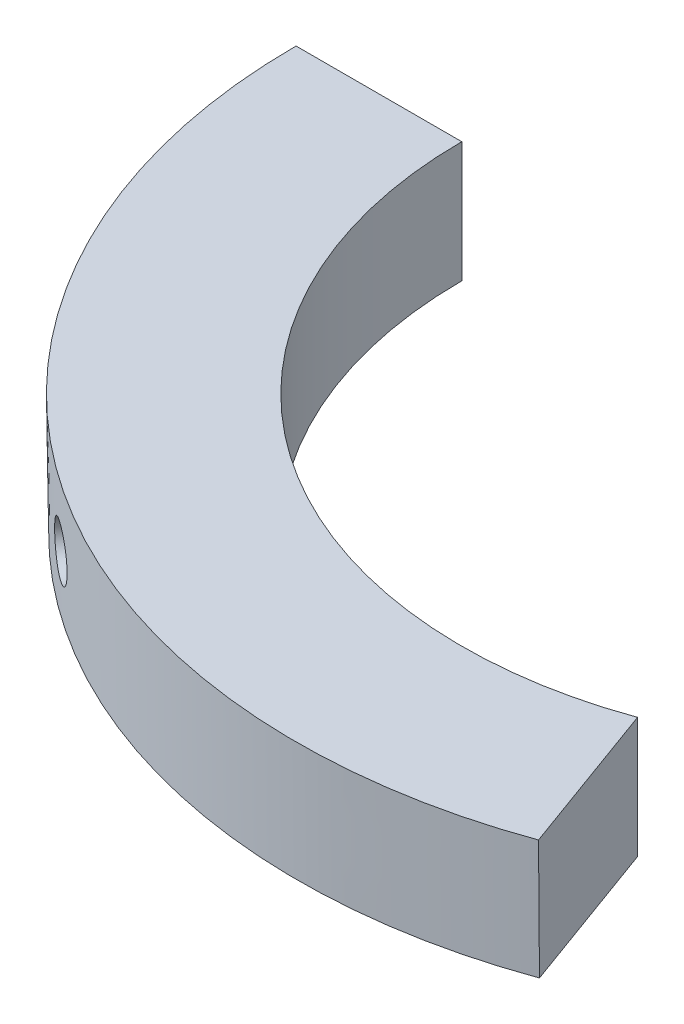
ISO-10303-21;
HEADER;
FILE_DESCRIPTION(('STEP AP214'),'2;1');
FILE_NAME('part.step','',(''),(''),'','','');
FILE_SCHEMA(('AUTOMOTIVE_DESIGN { 1 0 10303 214 1 1 1 1 }'));
ENDSEC;
DATA;
#1=APPLICATION_CONTEXT('core data for automotive mechanical design processes');
#2=APPLICATION_PROTOCOL_DEFINITION('international standard','automotive_design',2000,#1);
#3=PRODUCT_CONTEXT('',#1,'mechanical');
#4=PRODUCT('Part','Part','',(#3));
#5=PRODUCT_RELATED_PRODUCT_CATEGORY('part','',(#4));
#6=PRODUCT_DEFINITION_FORMATION('','',#4);
#7=PRODUCT_DEFINITION_CONTEXT('part definition',#1,'design');
#8=PRODUCT_DEFINITION('design','',#6,#7);
#9=PRODUCT_DEFINITION_SHAPE('','',#8);
#10=(LENGTH_UNIT() NAMED_UNIT(*) SI_UNIT(.MILLI.,.METRE.));
#11=(NAMED_UNIT(*) PLANE_ANGLE_UNIT() SI_UNIT($,.RADIAN.));
#12=(NAMED_UNIT(*) SI_UNIT($,.STERADIAN.) SOLID_ANGLE_UNIT());
#13=UNCERTAINTY_MEASURE_WITH_UNIT(LENGTH_MEASURE(1.E-05),#10,'distance_accuracy_value','');
#14=(GEOMETRIC_REPRESENTATION_CONTEXT(3) GLOBAL_UNCERTAINTY_ASSIGNED_CONTEXT((#13)) GLOBAL_UNIT_ASSIGNED_CONTEXT((#10,
#11,#12)) REPRESENTATION_CONTEXT('',''));
#15=CARTESIAN_POINT('',(0.,0.,0.));
#16=DIRECTION('',(0.,0.,1.));
#17=DIRECTION('',(1.,0.,0.));
#18=AXIS2_PLACEMENT_3D('',#15,#16,#17);
#19=CARTESIAN_POINT('',(9.91858415644451,8.,27.2510860027913));
#20=DIRECTION('',(0.,-1.,0.));
#21=DIRECTION('',(0.,0.,-1.));
#22=AXIS2_PLACEMENT_3D('',#19,#20,#21);
#23=PLANE('',#22);
#24=CARTESIAN_POINT('',(0.,8.,0.));
#25=DIRECTION('',(0.,-1.,0.));
#26=DIRECTION('',(0.,0.,-1.));
#27=AXIS2_PLACEMENT_3D('',#24,#25,#26);
#28=CIRCLE('',#27,29.);
#29=CARTESIAN_POINT('',(9.91858415644451,8.,27.2510860027913));
#30=VERTEX_POINT('',#29);
#31=CARTESIAN_POINT('',(-29.,8.,0.));
#32=VERTEX_POINT('',#31);
#33=EDGE_CURVE('E11',#30,#32,#28,.T.);
#34=ORIENTED_EDGE('',*,*,#33,.T.);
#35=DIRECTION('',(-1.,0.,0.));
#36=VECTOR('',#35,1.);
#37=CARTESIAN_POINT('',(-29.,8.,0.));
#38=LINE('',#37,#36);
#39=CARTESIAN_POINT('',(-40.,7.99999999999999,0.));
#40=VERTEX_POINT('',#39);
#41=EDGE_CURVE('E94',#32,#40,#38,.T.);
#42=ORIENTED_EDGE('',*,*,#41,.T.);
#43=CARTESIAN_POINT('',(0.,7.99999999999999,0.));
#44=DIRECTION('',(0.,-1.,0.));
#45=DIRECTION('',(0.,0.,-1.));
#46=AXIS2_PLACEMENT_3D('',#43,#44,#45);
#47=CIRCLE('',#46,40.);
#48=CARTESIAN_POINT('',(13.6808057330269,7.99999999999999,37.5877048314363));
#49=VERTEX_POINT('',#48);
#50=EDGE_CURVE('E151',#49,#40,#47,.T.);
#51=ORIENTED_EDGE('',*,*,#50,.F.);
#52=DIRECTION('',(0.342020143325673,0.,0.939692620785907));
#53=VECTOR('',#52,1.);
#54=CARTESIAN_POINT('',(9.91858415644451,8.,27.2510860027913));
#55=LINE('',#54,#53);
#56=EDGE_CURVE('E161',#30,#49,#55,.T.);
#57=ORIENTED_EDGE('',*,*,#56,.F.);
#58=EDGE_LOOP('',(#34,#42,#51,#57));
#59=FACE_BOUND('',#58,.T.);
#60=ADVANCED_FACE('F33',(#59),#23,.F.);
#61=CARTESIAN_POINT('',(0.,0.,0.));
#62=DIRECTION('',(0.,-1.,0.));
#63=DIRECTION('',(0.,0.,-1.));
#64=AXIS2_PLACEMENT_3D('',#61,#62,#63);
#65=CYLINDRICAL_SURFACE('',#64,29.);
#66=CARTESIAN_POINT('',(-16.6932287008392,0.649474551576168,23.7136272118265));
#67=CARTESIAN_POINT('',(-16.5489999556268,0.64948214656556,23.8151544921271));
#68=CARTESIAN_POINT('',(-16.4037439585356,0.664338604365094,23.9154215427874));
#69=CARTESIAN_POINT('',(-16.1154682046601,0.723376379007501,24.1106218136091));
#70=CARTESIAN_POINT('',(-15.9724510424347,0.767589464135116,24.2055491345346));
#71=CARTESIAN_POINT('',(-15.6931209410602,0.884033140541949,24.3875733311172));
#72=CARTESIAN_POINT('',(-15.5568038638344,0.956246187246734,24.4746750682164));
#73=CARTESIAN_POINT('',(-15.294984883665,1.12660442333295,24.6391430593461));
#74=CARTESIAN_POINT('',(-15.1694809311329,1.22474468390133,24.7165111596373));
#75=CARTESIAN_POINT('',(-14.932723824081,1.44461432831995,24.8602703957436));
#76=CARTESIAN_POINT('',(-14.821525867094,1.56643077946276,24.9266192859318));
#77=CARTESIAN_POINT('',(-14.6175122704299,1.83000864498745,25.0468039865723));
#78=CARTESIAN_POINT('',(-14.524697507627,1.97177101023343,25.1006392001463));
#79=CARTESIAN_POINT('',(-14.3603233498682,2.27165723790005,25.195042227695));
#80=CARTESIAN_POINT('',(-14.2888180309886,2.42982137568048,25.2355763138507));
#81=CARTESIAN_POINT('',(-14.169836482929,2.7577429622307,25.3025774246436));
#82=CARTESIAN_POINT('',(-14.1223595593769,2.92750007582608,25.3290448557797));
#83=CARTESIAN_POINT('',(-14.0532448125366,3.27307580418684,25.367457175145));
#84=CARTESIAN_POINT('',(-14.0315053730862,3.44886774233842,25.379459178862));
#85=CARTESIAN_POINT('',(-14.0143003498141,3.80211861102713,25.388963895097));
#86=CARTESIAN_POINT('',(-14.0188339587404,3.97957749017943,25.3864670530989));
#87=CARTESIAN_POINT('',(-14.0539344207779,4.33032261974512,25.3670517964536));
#88=CARTESIAN_POINT('',(-14.0843895545301,4.50362350001804,25.3501952704377));
#89=CARTESIAN_POINT('',(-14.1701127401262,4.84194300421424,25.3023772222597));
#90=CARTESIAN_POINT('',(-14.2253811811965,5.00696149817329,25.2714154788404));
#91=CARTESIAN_POINT('',(-14.3589696041779,5.32443095731625,25.1957509769842));
#92=CARTESIAN_POINT('',(-14.4373377924936,5.47685477860741,25.1510194739636));
#93=CARTESIAN_POINT('',(-14.6144522540094,5.76451098077571,25.048517327861));
#94=CARTESIAN_POINT('',(-14.713199231329,5.89974276737966,24.9907462342339));
#95=CARTESIAN_POINT('',(-14.9284159747827,6.14991377023516,24.862785716952));
#96=CARTESIAN_POINT('',(-15.0449753493423,6.26474365242543,24.7925331951435));
#97=CARTESIAN_POINT('',(-15.2917026261313,6.47000258894143,24.6411190007649));
#98=CARTESIAN_POINT('',(-15.4218705480971,6.56043160787822,24.5599573123732));
#99=CARTESIAN_POINT('',(-15.6917707801985,6.7143189095837,24.388396319614));
#100=CARTESIAN_POINT('',(-15.831505196858,6.77777122981352,24.2979949785186));
#101=CARTESIAN_POINT('',(-16.1162226230965,6.87582170067299,24.110089957242));
#102=CARTESIAN_POINT('',(-16.2612054471995,6.91042086992089,24.0125865279217));
#103=CARTESIAN_POINT('',(-16.5513422063985,6.94964323220379,23.813522631559));
#104=CARTESIAN_POINT('',(-16.6964915637939,6.95441721413793,23.7119851889403));
#105=CARTESIAN_POINT('',(-16.9835199275088,6.93425033432527,23.5072569263861));
#106=CARTESIAN_POINT('',(-17.1253989860754,6.90930994763858,23.4040661329097));
#107=CARTESIAN_POINT('',(-17.4016378380506,6.83054745272621,23.199407216518));
#108=CARTESIAN_POINT('',(-17.5360152275116,6.77679636273557,23.0979354879191));
#109=CARTESIAN_POINT('',(-17.7941265933511,6.64201151218522,22.8996848736341));
#110=CARTESIAN_POINT('',(-17.9178602907999,6.56097703690759,22.8029061109613));
#111=CARTESIAN_POINT('',(-18.1520836221764,6.3735546573513,22.6169039581311));
#112=CARTESIAN_POINT('',(-18.2625191840447,6.26706817125197,22.5277118207458));
#113=CARTESIAN_POINT('',(-18.4669570911248,6.03190527229278,22.3604333021115));
#114=CARTESIAN_POINT('',(-18.5609589478609,5.90322820006542,22.2823472509928));
#115=CARTESIAN_POINT('',(-18.7307367590176,5.62667681043193,22.1398254990495));
#116=CARTESIAN_POINT('',(-18.8064332746414,5.47872296180764,22.0754494339169));
#117=CARTESIAN_POINT('',(-18.9373628341602,5.16820810750318,21.9632364607781));
#118=CARTESIAN_POINT('',(-18.9925962008302,5.00564733227533,21.9153992918965));
#119=CARTESIAN_POINT('',(-19.0812659982208,4.67086716025938,21.838240752812));
#120=CARTESIAN_POINT('',(-19.1147468791267,4.49866824612972,21.8088816274592));
#121=CARTESIAN_POINT('',(-19.1593370811455,4.14922552791051,21.7697197390596));
#122=CARTESIAN_POINT('',(-19.1704471702185,3.97198189721136,21.7599163046914));
#123=CARTESIAN_POINT('',(-19.1700483522398,3.61846811660654,21.7602675542439));
#124=CARTESIAN_POINT('',(-19.1586570973353,3.44219771020977,21.7703184265163));
#125=CARTESIAN_POINT('',(-19.1137454613566,3.09471436495632,21.8097596187874));
#126=CARTESIAN_POINT('',(-19.0802250617306,2.92350143033967,21.8391499549993));
#127=CARTESIAN_POINT('',(-18.9918106977869,2.59100061415647,21.9160793683163));
#128=CARTESIAN_POINT('',(-18.9369209739132,2.42971077083976,21.9636148447354));
#129=CARTESIAN_POINT('',(-18.8069865498785,2.12152061542658,22.0749755605313));
#130=CARTESIAN_POINT('',(-18.7319418444426,1.97462030709597,22.1388008041713));
#131=CARTESIAN_POINT('',(-18.5629463616414,1.69858022757664,22.2806916924656));
#132=CARTESIAN_POINT('',(-18.4689025347671,1.5695333503358,22.3588272396232));
#133=CARTESIAN_POINT('',(-18.2642790566204,1.33365812734902,22.5262857730101));
#134=CARTESIAN_POINT('',(-18.1536954712934,1.22683508213214,22.6156114200308));
#135=CARTESIAN_POINT('',(-17.9183153333047,1.03818670109254,22.8025571538631));
#136=CARTESIAN_POINT('',(-17.7934782443324,0.956435226578116,22.9002006858224));
#137=CARTESIAN_POINT('',(-17.5330758769043,0.820783703932582,23.1001751188821));
#138=CARTESIAN_POINT('',(-17.3975227502445,0.766852615959477,23.2025006567244));
#139=CARTESIAN_POINT('',(-17.1666089802473,0.70164951429629,23.373503624662));
#140=CARTESIAN_POINT('',(-17.0732250014389,0.682111074041779,23.4418118157774));
#141=CARTESIAN_POINT('',(-16.8844547725775,0.656021102259471,23.5781412293489));
#142=CARTESIAN_POINT('',(-16.7890685327052,0.649469504714634,23.646162453262));
#143=CARTESIAN_POINT('',(-16.6932287008392,0.649474551576168,23.7136272118265));
#144=B_SPLINE_CURVE_WITH_KNOTS('',3,(#66,#67,#68,#69,#70,#71,#72,#73,#74,#75,#76,#77,#78,#79,
#80,#81,#82,#83,#84,#85,#86,#87,#88,#89,#90,#91,#92,#93,#94,#95,#96,#97,#98,#99,#100,#101,#102,
#103,#104,#105,#106,#107,#108,#109,#110,#111,#112,#113,#114,#115,#116,#117,#118,#119,#120,#121,
#122,#123,#124,#125,#126,#127,#128,#129,#130,#131,#132,#133,#134,#135,#136,#137,#138,#139,#140,
#141,#142,#143),.UNSPECIFIED.,.T.,.F.,(4,2,2,2,2,2,2,2,2,2,2,2,2,2,2,2,2,2,2,2,2,2,2,2,2,2,2,2,
2,2,2,2,2,2,2,2,2,2,4),(0.,0.52871040460765,1.0579938878802,1.58694626048054,2.11579815048801,
2.64663296149886,3.17749308711254,3.7096891019091,4.24186973644208,4.77194214481608,
5.30199826654555,5.82978139684763,6.35757280634521,6.88647354697578,7.41539256503064,
7.94706576503542,8.47873973612954,9.01053115972378,9.54230380840551,10.0713857534895,
10.6004592399601,11.1282345206174,11.6560236279975,12.1858910981398,12.7157743153923,
13.2479173567005,13.7800520039039,14.3110958099924,14.8421213857274,15.3703777519355,
15.898634561005,16.4267865982752,16.9549387737673,17.4857432095958,18.016674100977,
18.5491544232548,19.0810393530426,19.4323685821309,19.783696025275),.UNSPECIFIED.);
#145=CARTESIAN_POINT('',(-16.6932287008392,0.649474551576168,23.7136272118265));
#146=VERTEX_POINT('',#145);
#147=CARTESIAN_POINT('',(-16.6932287008392,6.94947455157617,23.7136272118265));
#148=VERTEX_POINT('',#147);
#149=EDGE_CURVE('E90',#146,#148,#144,.T.);
#150=ORIENTED_EDGE('',*,*,#149,.T.);
#151=EDGE_CURVE('E95',#148,#146,#144,.T.);
#152=ORIENTED_EDGE('',*,*,#151,.T.);
#153=EDGE_LOOP('',(#150,#152));
#154=FACE_BOUND('',#153,.T.);
#155=CARTESIAN_POINT('',(0.,0.,0.));
#156=DIRECTION('',(0.,-1.,0.));
#157=DIRECTION('',(0.,0.,-1.));
#158=AXIS2_PLACEMENT_3D('',#155,#156,#157);
#159=CIRCLE('',#158,29.);
#160=CARTESIAN_POINT('',(9.91858415644451,0.,27.2510860027913));
#161=VERTEX_POINT('',#160);
#162=CARTESIAN_POINT('',(-29.,0.,0.));
#163=VERTEX_POINT('',#162);
#164=EDGE_CURVE('E47',#161,#163,#159,.T.);
#165=ORIENTED_EDGE('',*,*,#164,.T.);
#166=DIRECTION('',(0.,1.,0.));
#167=VECTOR('',#166,1.);
#168=CARTESIAN_POINT('',(-29.,0.,0.));
#169=LINE('',#168,#167);
#170=EDGE_CURVE('E159',#163,#32,#169,.T.);
#171=ORIENTED_EDGE('',*,*,#170,.T.);
#172=ORIENTED_EDGE('',*,*,#33,.F.);
#173=DIRECTION('',(0.,1.,0.));
#174=VECTOR('',#173,1.);
#175=CARTESIAN_POINT('',(9.91858415644451,0.,27.2510860027913));
#176=LINE('',#175,#174);
#177=EDGE_CURVE('E169',#161,#30,#176,.T.);
#178=ORIENTED_EDGE('',*,*,#177,.F.);
#179=EDGE_LOOP('',(#165,#171,#172,#178));
#180=FACE_BOUND('',#179,.T.);
#181=ADVANCED_FACE('F35',(#154,#180),#65,.F.);
#182=CARTESIAN_POINT('',(0.,0.000670605463265819,0.));
#183=DIRECTION('',(0.,1.,0.));
#184=DIRECTION('',(0.,0.,1.));
#185=AXIS2_PLACEMENT_3D('',#182,#183,#184);
#186=CONICAL_SURFACE('',#185,39.8964179663232,1.57073478313307);
#187=CARTESIAN_POINT('',(0.,0.000670605463265819,0.));
#188=DIRECTION('',(0.,-1.,0.));
#189=DIRECTION('',(0.,0.,-1.));
#190=AXIS2_PLACEMENT_3D('',#187,#188,#189);
#191=CIRCLE('',#190,39.8964179663232);
#192=CARTESIAN_POINT('',(13.6453785910228,0.000670605463265819,37.4903695587442));
#193=VERTEX_POINT('',#192);
#194=CARTESIAN_POINT('',(-39.8964179663232,0.000670605463265819,0.));
#195=VERTEX_POINT('',#194);
#196=EDGE_CURVE('E141',#193,#195,#191,.T.);
#197=ORIENTED_EDGE('',*,*,#196,.T.);
#198=DIRECTION('',(0.999999998106189,-6.15436617860995E-05,0.));
#199=VECTOR('',#198,1.);
#200=CARTESIAN_POINT('',(-39.8964179663232,0.000670605463265819,0.));
#201=LINE('',#200,#199);
#202=EDGE_CURVE('E144',#195,#163,#201,.T.);
#203=ORIENTED_EDGE('',*,*,#202,.T.);
#204=ORIENTED_EDGE('',*,*,#164,.F.);
#205=DIRECTION('',(-0.342020142677951,-6.15436617860995E-05,-0.939692619006307));
#206=VECTOR('',#205,1.);
#207=CARTESIAN_POINT('',(13.6453785910228,0.000670605463265819,37.4903695587442));
#208=LINE('',#207,#206);
#209=EDGE_CURVE('E147',#193,#161,#208,.T.);
#210=ORIENTED_EDGE('',*,*,#209,.F.);
#211=EDGE_LOOP('',(#197,#203,#204,#210));
#212=FACE_BOUND('',#211,.T.);
#213=ADVANCED_FACE('F128',(#212),#186,.T.);
#214=CARTESIAN_POINT('',(0.,7.99999999999999,0.));
#215=DIRECTION('',(0.,1.,0.));
#216=DIRECTION('',(0.,0.,1.));
#217=AXIS2_PLACEMENT_3D('',#214,#215,#216);
#218=CONICAL_SURFACE('',#217,40.,0.0129481160065154);
#219=CARTESIAN_POINT('',(-24.0939384024121,2.79442062885744,31.8448454047312));
#220=CARTESIAN_POINT('',(-24.1395296013633,2.87139102040606,31.8116008732006));
#221=CARTESIAN_POINT('',(-24.1799375421515,2.95317920602283,31.7822067786381));
#222=CARTESIAN_POINT('',(-24.2492775488978,3.12404954510178,31.7321183395056));
#223=CARTESIAN_POINT('',(-24.2781960522706,3.21314016995506,31.7114342748845));
#224=CARTESIAN_POINT('',(-24.3237503791073,3.39599259554247,31.679491387969));
#225=CARTESIAN_POINT('',(-24.3403916986118,3.48975228601744,31.668228347928));
#226=CARTESIAN_POINT('',(-24.3609729232629,3.67928299841592,31.6554958057005));
#227=CARTESIAN_POINT('',(-24.3649159334633,3.77505352287434,31.6540239092411));
#228=CARTESIAN_POINT('',(-24.3600110461444,3.9658943767998,31.6609167089078));
#229=CARTESIAN_POINT('',(-24.3511653314653,4.06096482297589,31.6692797263186));
#230=CARTESIAN_POINT('',(-24.3209163737099,4.24773014900668,31.6955640380058));
#231=CARTESIAN_POINT('',(-24.2995125981556,4.33942488555175,31.7134857375796));
#232=CARTESIAN_POINT('',(-24.2446860916856,4.51689323913144,31.7583107366114));
#233=CARTESIAN_POINT('',(-24.2112562606828,4.60266332256508,31.7852193411928));
#234=CARTESIAN_POINT('',(-24.1332488275521,4.76579801425707,31.8471378729958));
#235=CARTESIAN_POINT('',(-24.0886711681305,4.8431625793128,31.8821478418538));
#236=CARTESIAN_POINT('',(-23.989484595836,4.9873711215836,31.95918149535));
#237=CARTESIAN_POINT('',(-23.934865840032,5.05420465516582,32.0012120582999));
#238=CARTESIAN_POINT('',(-23.8170718217642,5.17536370001862,32.0909307489857));
#239=CARTESIAN_POINT('',(-23.7538965744698,5.22968923346343,32.1386188666916));
#240=CARTESIAN_POINT('',(-23.6206910002924,5.32428256039368,32.2381647264483));
#241=CARTESIAN_POINT('',(-23.5506613053632,5.36455164826918,32.2900220840327));
#242=CARTESIAN_POINT('',(-23.4056532343915,5.42988805816941,32.3963297525079));
#243=CARTESIAN_POINT('',(-23.330674894873,5.45495549237769,32.4507800442604));
#244=CARTESIAN_POINT('',(-23.1779501944409,5.48914780887046,32.5605820325172));
#245=CARTESIAN_POINT('',(-23.1002074940119,5.49829302743525,32.6159324879203));
#246=CARTESIAN_POINT('',(-22.944055246314,5.5004411530929,32.7260017378651));
#247=CARTESIAN_POINT('',(-22.8656457033741,5.49344416490229,32.7807205365021));
#248=CARTESIAN_POINT('',(-22.7104714641959,5.46352202132961,32.8879445817203));
#249=CARTESIAN_POINT('',(-22.6337053991269,5.44061069876084,32.9404517086897));
#250=CARTESIAN_POINT('',(-22.4839694029538,5.37952954909623,33.0418808624408));
#251=CARTESIAN_POINT('',(-22.4109994877358,5.34135965815199,33.0908028742198));
#252=CARTESIAN_POINT('',(-22.2709435577136,5.25081682901953,33.1838141588291));
#253=CARTESIAN_POINT('',(-22.2038616084831,5.19843417761459,33.2279000975716));
#254=CARTESIAN_POINT('',(-22.0776230356181,5.0809637314418,33.3100858907028));
#255=CARTESIAN_POINT('',(-22.0184664793061,5.01587582876051,33.3481856942427));
#256=CARTESIAN_POINT('',(-21.9097748319121,4.8747409658401,33.4175118298452));
#257=CARTESIAN_POINT('',(-21.8602526725794,4.79867951148403,33.4487289309998));
#258=CARTESIAN_POINT('',(-21.7724277307152,4.63781547338798,33.5034783533966));
#259=CARTESIAN_POINT('',(-21.7341249711578,4.55301287174909,33.5270106589025));
#260=CARTESIAN_POINT('',(-21.6699007783876,4.37704106698968,33.5658452501568));
#261=CARTESIAN_POINT('',(-21.6439830246134,4.28586998107683,33.5811450903072));
#262=CARTESIAN_POINT('',(-21.6053468367506,4.09977126100728,33.6031510676907));
#263=CARTESIAN_POINT('',(-21.5926283246692,4.00484364905088,33.6098572557029));
#264=CARTESIAN_POINT('',(-21.5807923213898,3.8140184178223,33.6145220517851));
#265=CARTESIAN_POINT('',(-21.5816624378912,3.71812176204687,33.612488631265));
#266=CARTESIAN_POINT('',(-21.5969484838023,3.52799958356373,33.5997423711656));
#267=CARTESIAN_POINT('',(-21.6113643584456,3.4337740541011,33.5890295666777));
#268=CARTESIAN_POINT('',(-21.6532809551154,3.24974143181988,33.559187037246));
#269=CARTESIAN_POINT('',(-21.680772077802,3.15993115078251,33.5400634879191));
#270=CARTESIAN_POINT('',(-21.7479891741358,2.98720314394725,33.4938508025015));
#271=CARTESIAN_POINT('',(-21.7877151606931,2.90428542542249,33.4667616580056));
#272=CARTESIAN_POINT('',(-21.8782009881201,2.74766943937043,33.4052541126801));
#273=CARTESIAN_POINT('',(-21.9289640527469,2.67397387541912,33.3708335705246));
#274=CARTESIAN_POINT('',(-22.0399794907007,2.53791765300234,33.2955039624899));
#275=CARTESIAN_POINT('',(-22.1002319150921,2.47555705553676,33.2545948616944));
#276=CARTESIAN_POINT('',(-22.2284579210725,2.36390448485933,33.1672808917314));
#277=CARTESIAN_POINT('',(-22.2964360107483,2.31462019845464,33.1208728131158));
#278=CARTESIAN_POINT('',(-22.4380685270756,2.23056730543352,33.0237706561101));
#279=CARTESIAN_POINT('',(-22.5117229602602,2.19579871552412,32.9730765727871));
#280=CARTESIAN_POINT('',(-22.6625478669048,2.1417664290177,32.8687464649716));
#281=CARTESIAN_POINT('',(-22.7397182322743,2.12250225610696,32.8151105309103));
#282=CARTESIAN_POINT('',(-22.8953428738002,2.10002616406782,32.7063647343127));
#283=CARTESIAN_POINT('',(-22.9737970970257,2.0968135848301,32.6512549324818));
#284=CARTESIAN_POINT('',(-23.1297172630453,2.10652729354082,32.5411434706769));
#285=CARTESIAN_POINT('',(-23.207183677866,2.11944555718545,32.4861417705556));
#286=CARTESIAN_POINT('',(-23.3590168927314,2.16104724075257,32.3778031493206));
#287=CARTESIAN_POINT('',(-23.4333829288717,2.189734521603,32.3244666392977));
#288=CARTESIAN_POINT('',(-23.576975055682,2.26207206729953,32.2210435867348));
#289=CARTESIAN_POINT('',(-23.6461983313071,2.30573045467268,32.1709588260014));
#290=CARTESIAN_POINT('',(-23.7775244098635,2.40674057966542,32.0756459078334));
#291=CARTESIAN_POINT('',(-23.8396355111921,2.46407611296481,32.0304120943675));
#292=CARTESIAN_POINT('',(-23.9338431881871,2.5674245430314,31.9617037339569));
#293=CARTESIAN_POINT('',(-23.9685760130487,2.60984396475162,31.936345877162));
#294=CARTESIAN_POINT('',(-24.0342095002533,2.6990070339052,31.8884273083383));
#295=CARTESIAN_POINT('',(-24.0651101598396,2.7457506844492,31.8658665983216));
#296=CARTESIAN_POINT('',(-24.0939384024121,2.79442062885744,31.8448454047312));
#297=B_SPLINE_CURVE_WITH_KNOTS('',3,(#219,#220,#221,#222,#223,#224,#225,#226,#227,#228,#229,
#230,#231,#232,#233,#234,#235,#236,#237,#238,#239,#240,#241,#242,#243,#244,#245,#246,#247,#248,
#249,#250,#251,#252,#253,#254,#255,#256,#257,#258,#259,#260,#261,#262,#263,#264,#265,#266,#267,
#268,#269,#270,#271,#272,#273,#274,#275,#276,#277,#278,#279,#280,#281,#282,#283,#284,#285,#286,
#287,#288,#289,#290,#291,#292,#293,#294,#295,#296),.UNSPECIFIED.,.T.,.F.,(4,2,2,2,2,2,2,2,2,2,2,
2,2,2,2,2,2,2,2,2,2,2,2,2,2,2,2,2,2,2,2,2,2,2,2,2,2,2,4),(0.,0.286090664777561,
0.572518045959458,0.858817126271774,1.14504619399091,1.4312264125426,1.71741876638049,
2.00378036394901,2.29014343328697,2.57678872567191,2.86343350988691,3.15005189140269,
3.43666815773684,3.72291808080772,4.00916614694434,4.29516571577547,4.5811664813641,
4.86736319870032,5.15356234698574,5.44014303448444,5.72672430881477,6.0133906701991,
6.30005533769552,6.5864585934423,6.87286069124235,7.1590528475349,7.44524530581728,
7.73152146898429,8.0177991727202,8.30424479157592,8.59069074011922,8.87712788837394,
9.16355325702664,9.44983619984084,9.73618926817098,10.0226979429147,10.3088688410986,
10.4897696583341,10.6706706057022),.UNSPECIFIED.);
#298=CARTESIAN_POINT('',(-24.0939384024121,2.79442062885744,31.8448454047312));
#299=VERTEX_POINT('',#298);
#300=EDGE_CURVE('E37',#299,#299,#297,.T.);
#301=ORIENTED_EDGE('',*,*,#300,.T.);
#302=EDGE_LOOP('',(#301));
#303=FACE_BOUND('',#302,.T.);
#304=DIRECTION('',(-0.00442839275051456,-0.999916174317091,-0.0121669090865151));
#305=VECTOR('',#304,1.);
#306=CARTESIAN_POINT('',(13.6808057330269,7.99999999999999,37.5877048314363));
#307=LINE('',#306,#305);
#308=EDGE_CURVE('E166',#49,#193,#307,.T.);
#309=ORIENTED_EDGE('',*,*,#308,.F.);
#310=ORIENTED_EDGE('',*,*,#50,.T.);
#311=DIRECTION('',(0.0129477542096046,-0.999916174317091,0.));
#312=VECTOR('',#311,1.);
#313=CARTESIAN_POINT('',(-40.,7.99999999999999,0.));
#314=LINE('',#313,#312);
#315=EDGE_CURVE('E154',#40,#195,#314,.T.);
#316=ORIENTED_EDGE('',*,*,#315,.T.);
#317=ORIENTED_EDGE('',*,*,#196,.F.);
#318=EDGE_LOOP('',(#309,#310,#316,#317));
#319=FACE_BOUND('',#318,.T.);
#320=ADVANCED_FACE('F131',(#303,#319),#218,.T.);
#321=CARTESIAN_POINT('',(0.,0.,0.));
#322=DIRECTION('',(-0.939692620785907,0.,0.342020143325673));
#323=DIRECTION('',(0.342020143325673,0.,0.939692620785907));
#324=AXIS2_PLACEMENT_3D('',#321,#322,#323);
#325=PLANE('',#324);
#326=ORIENTED_EDGE('',*,*,#56,.T.);
#327=ORIENTED_EDGE('',*,*,#308,.T.);
#328=ORIENTED_EDGE('',*,*,#209,.T.);
#329=ORIENTED_EDGE('',*,*,#177,.T.);
#330=EDGE_LOOP('',(#326,#327,#328,#329));
#331=FACE_BOUND('',#330,.T.);
#332=ADVANCED_FACE('F130',(#331),#325,.F.);
#333=CARTESIAN_POINT('',(0.,0.,0.));
#334=DIRECTION('',(0.,0.,-1.));
#335=DIRECTION('',(-1.,0.,0.));
#336=AXIS2_PLACEMENT_3D('',#333,#334,#335);
#337=PLANE('',#336);
#338=ORIENTED_EDGE('',*,*,#41,.F.);
#339=ORIENTED_EDGE('',*,*,#170,.F.);
#340=ORIENTED_EDGE('',*,*,#202,.F.);
#341=ORIENTED_EDGE('',*,*,#315,.F.);
#342=EDGE_LOOP('',(#338,#339,#340,#341));
#343=FACE_BOUND('',#342,.T.);
#344=ADVANCED_FACE('F158',(#343),#337,.T.);
#345=CARTESIAN_POINT('',(-16.6932287008392,3.79947455157617,23.7136272118265));
#346=DIRECTION('',(0.575628575891007,0.,-0.817711283166431));
#347=DIRECTION('',(-0.817711283166431,0.,-0.575628575891007));
#348=AXIS2_PLACEMENT_3D('',#345,#346,#347);
#349=CYLINDRICAL_SURFACE('',#348,3.15);
#350=CARTESIAN_POINT('',(-16.6932287008392,3.79947455157617,23.7136272118265));
#351=DIRECTION('',(0.575628575891007,0.,-0.817711283166431));
#352=DIRECTION('',(-0.817711283166431,0.,-0.575628575891007));
#353=AXIS2_PLACEMENT_3D('',#350,#351,#352);
#354=CIRCLE('',#353,3.15);
#355=EDGE_CURVE('E82',#148,#146,#354,.T.);
#356=ORIENTED_EDGE('',*,*,#355,.F.);
#357=ORIENTED_EDGE('',*,*,#149,.F.);
#358=EDGE_LOOP('',(#356,#357));
#359=FACE_BOUND('',#358,.T.);
#360=ADVANCED_FACE('F91',(#359),#349,.F.);
#361=CARTESIAN_POINT('',(-16.6932287008392,3.79947455157617,23.7136272118265));
#362=DIRECTION('',(0.575628575891007,0.,-0.817711283166431));
#363=DIRECTION('',(-0.817711283166431,0.,-0.575628575891007));
#364=AXIS2_PLACEMENT_3D('',#361,#362,#363);
#365=CIRCLE('',#364,3.15);
#366=EDGE_CURVE('E53',#146,#148,#365,.T.);
#367=ORIENTED_EDGE('',*,*,#366,.F.);
#368=ORIENTED_EDGE('',*,*,#151,.F.);
#369=EDGE_LOOP('',(#367,#368));
#370=FACE_BOUND('',#369,.T.);
#371=ADVANCED_FACE('F98',(#370),#349,.F.);
#372=CARTESIAN_POINT('',(-16.6932287008392,3.79947455157617,23.7136272118265));
#373=DIRECTION('',(0.575628575891007,0.,-0.817711283166431));
#374=DIRECTION('',(-0.817711283166431,0.,-0.575628575891007));
#375=AXIS2_PLACEMENT_3D('',#372,#373,#374);
#376=CYLINDRICAL_SURFACE('',#375,1.69999999999999);
#377=CARTESIAN_POINT('',(-17.5278901358812,3.79947455157617,24.8993085724178));
#378=DIRECTION('',(0.575628575891007,0.,-0.817711283166431));
#379=DIRECTION('',(-0.817711283166431,0.,-0.575628575891007));
#380=AXIS2_PLACEMENT_3D('',#377,#378,#379);
#381=CIRCLE('',#380,1.69999999999999);
#382=CARTESIAN_POINT('',(-18.9179993172641,3.79947455157617,23.9207399934031));
#383=VERTEX_POINT('',#382);
#384=EDGE_CURVE('E87',#383,#383,#381,.T.);
#385=ORIENTED_EDGE('',*,*,#384,.T.);
#386=EDGE_LOOP('',(#385));
#387=FACE_BOUND('',#386,.T.);
#388=ORIENTED_EDGE('',*,*,#300,.F.);
#389=EDGE_LOOP('',(#388));
#390=FACE_BOUND('',#389,.T.);
#391=ADVANCED_FACE('F112',(#387,#390),#376,.F.);
#392=CARTESIAN_POINT('',(-16.6932287008392,3.79947455157617,23.7136272118265));
#393=DIRECTION('',(0.575628575891007,0.,-0.817711283166431));
#394=DIRECTION('',(-0.817711283166431,0.,-0.575628575891007));
#395=AXIS2_PLACEMENT_3D('',#392,#393,#394);
#396=CONICAL_SURFACE('',#395,3.15,0.78539816339745);
#397=ORIENTED_EDGE('',*,*,#384,.F.);
#398=EDGE_LOOP('',(#397));
#399=FACE_BOUND('',#398,.T.);
#400=ORIENTED_EDGE('',*,*,#355,.T.);
#401=ORIENTED_EDGE('',*,*,#366,.T.);
#402=EDGE_LOOP('',(#400,#401));
#403=FACE_BOUND('',#402,.T.);
#404=ADVANCED_FACE('F84',(#399,#403),#396,.F.);
#405=CLOSED_SHELL('',(#60,#181,#213,#320,#332,#344,#360,#371,#391,#404));
#406=MANIFOLD_SOLID_BREP('B2',#405);
#407=ADVANCED_BREP_SHAPE_REPRESENTATION('',(#18,#406),#14);
#408=SHAPE_DEFINITION_REPRESENTATION(#9,#407);
ENDSEC;
END-ISO-10303-21;
